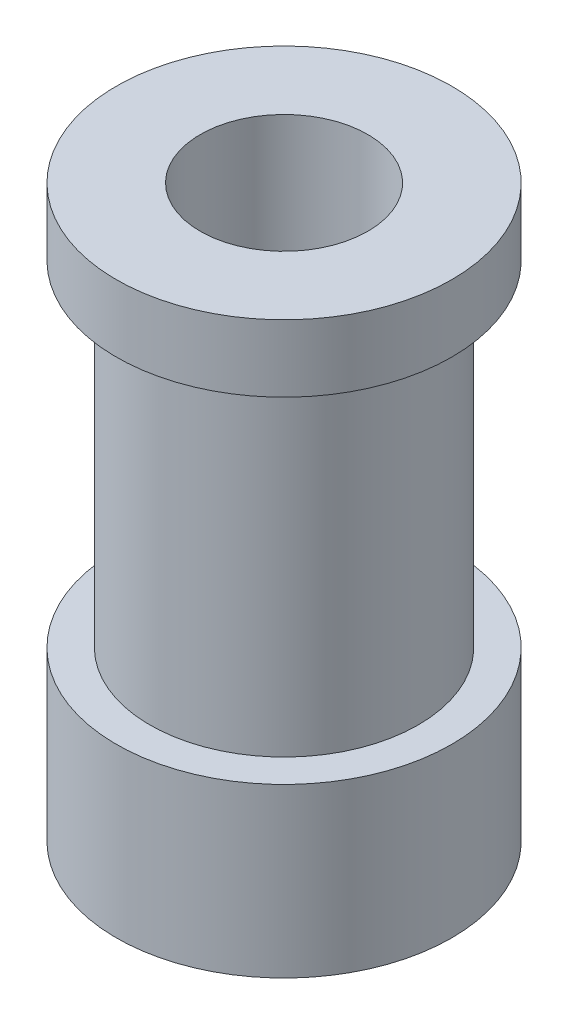
ISO-10303-21;
HEADER;
FILE_DESCRIPTION(('STEP AP214'),'2;1');
FILE_NAME('part.step','',(''),(''),'','','');
FILE_SCHEMA(('AUTOMOTIVE_DESIGN { 1 0 10303 214 1 1 1 1 }'));
ENDSEC;
DATA;
#1=APPLICATION_CONTEXT('core data for automotive mechanical design processes');
#2=APPLICATION_PROTOCOL_DEFINITION('international standard','automotive_design',2000,#1);
#3=PRODUCT_CONTEXT('',#1,'mechanical');
#4=PRODUCT('Part','Part','',(#3));
#5=PRODUCT_RELATED_PRODUCT_CATEGORY('part','',(#4));
#6=PRODUCT_DEFINITION_FORMATION('','',#4);
#7=PRODUCT_DEFINITION_CONTEXT('part definition',#1,'design');
#8=PRODUCT_DEFINITION('design','',#6,#7);
#9=PRODUCT_DEFINITION_SHAPE('','',#8);
#10=(LENGTH_UNIT() NAMED_UNIT(*) SI_UNIT(.MILLI.,.METRE.));
#11=(NAMED_UNIT(*) PLANE_ANGLE_UNIT() SI_UNIT($,.RADIAN.));
#12=(NAMED_UNIT(*) SI_UNIT($,.STERADIAN.) SOLID_ANGLE_UNIT());
#13=UNCERTAINTY_MEASURE_WITH_UNIT(LENGTH_MEASURE(1.E-05),#10,'distance_accuracy_value','');
#14=(GEOMETRIC_REPRESENTATION_CONTEXT(3) GLOBAL_UNCERTAINTY_ASSIGNED_CONTEXT((#13)) GLOBAL_UNIT_ASSIGNED_CONTEXT((#10,
#11,#12)) REPRESENTATION_CONTEXT('',''));
#15=CARTESIAN_POINT('',(0.,0.,0.));
#16=DIRECTION('',(0.,0.,1.));
#17=DIRECTION('',(1.,0.,0.));
#18=AXIS2_PLACEMENT_3D('',#15,#16,#17);
#19=CARTESIAN_POINT('',(0.,0.,0.));
#20=DIRECTION('',(0.,-1.,0.));
#21=DIRECTION('',(1.,0.,0.));
#22=AXIS2_PLACEMENT_3D('',#19,#20,#21);
#23=CYLINDRICAL_SURFACE('',#22,2.5);
#24=CARTESIAN_POINT('',(-2.29128784747792,2.5,-1.));
#25=CARTESIAN_POINT('',(-2.2912932582821,2.55356974904995,-0.999994127101895));
#26=CARTESIAN_POINT('',(-2.29319301242132,2.60721526735235,-0.995669909297177));
#27=CARTESIAN_POINT('',(-2.30055457093922,2.71296741643853,-0.978534515296366));
#28=CARTESIAN_POINT('',(-2.30602547693425,2.76506975854024,-0.965701652221066));
#29=CARTESIAN_POINT('',(-2.31980227895648,2.86602647098503,-0.932117516284353));
#30=CARTESIAN_POINT('',(-2.32809748178557,2.91489227368013,-0.911396076262713));
#31=CARTESIAN_POINT('',(-2.3465733254764,3.00844252542981,-0.862710134685806));
#32=CARTESIAN_POINT('',(-2.35675355451961,3.05312788457543,-0.834747214633751));
#33=CARTESIAN_POINT('',(-2.37850432525516,3.13963020112073,-0.770660987293711));
#34=CARTESIAN_POINT('',(-2.39011958979373,3.18117821146473,-0.734189678863665));
#35=CARTESIAN_POINT('',(-2.41306228489405,3.25776449865769,-0.654854552887023));
#36=CARTESIAN_POINT('',(-2.42438961368186,3.29280050064493,-0.611988510837841));
#37=CARTESIAN_POINT('',(-2.44601703953427,3.35670319849135,-0.519003155178191));
#38=CARTESIAN_POINT('',(-2.45625901841784,3.38527215073532,-0.468664482806142));
#39=CARTESIAN_POINT('',(-2.47401963815773,3.4334217841949,-0.363412661437561));
#40=CARTESIAN_POINT('',(-2.48153938692337,3.45300612289097,-0.308501384643982));
#41=CARTESIAN_POINT('',(-2.49269162504142,3.4816707432187,-0.198483213419447));
#42=CARTESIAN_POINT('',(-2.49649468387678,3.49121365704451,-0.143514492402304));
#43=CARTESIAN_POINT('',(-2.50040155341351,3.50101424283135,-0.032633164318827));
#44=CARTESIAN_POINT('',(-2.50050674384656,3.50127537796742,0.0232790829127));
#45=CARTESIAN_POINT('',(-2.49710981410893,3.49275861511251,0.131116247357655));
#46=CARTESIAN_POINT('',(-2.49380998385918,3.48448761362653,0.183088726437015));
#47=CARTESIAN_POINT('',(-2.48424645734395,3.46000356184462,0.284836554609168));
#48=CARTESIAN_POINT('',(-2.47798254360556,3.44378992879981,0.334611742195078));
#49=CARTESIAN_POINT('',(-2.4629841222885,3.40368175856185,0.431448969255827));
#50=CARTESIAN_POINT('',(-2.454213802334,3.37967514259223,0.478458811689816));
#51=CARTESIAN_POINT('',(-2.43507292589849,3.32476749654049,0.567904075370286));
#52=CARTESIAN_POINT('',(-2.42470182132537,3.29386410345119,0.610337921358053));
#53=CARTESIAN_POINT('',(-2.40260818589167,3.2236754320267,0.692384413996074));
#54=CARTESIAN_POINT('',(-2.3908416326012,3.18397305370808,0.73162892263682));
#55=CARTESIAN_POINT('',(-2.36780830482389,3.09850471408952,0.803053707692662));
#56=CARTESIAN_POINT('',(-2.35654169488173,3.05273677592292,0.835231671879827));
#57=CARTESIAN_POINT('',(-2.33548448720906,2.95479048879552,0.892452094371465));
#58=CARTESIAN_POINT('',(-2.3257445709069,2.90246758475809,0.917267325867451));
#59=CARTESIAN_POINT('',(-2.30943795233662,2.79389225476899,0.957588129983132));
#60=CARTESIAN_POINT('',(-2.3028691896167,2.73764240761458,0.973099749202198));
#61=CARTESIAN_POINT('',(-2.29414879836282,2.62648211128198,0.993477474415978));
#62=CARTESIAN_POINT('',(-2.29175183224037,2.57169977643992,0.998936048404204));
#63=CARTESIAN_POINT('',(-2.29094748938549,2.46196139611603,1.00078066322451));
#64=CARTESIAN_POINT('',(-2.29253890281231,2.40700540836108,0.99716945529644));
#65=CARTESIAN_POINT('',(-2.29928022178566,2.30177053252256,0.981516447394261));
#66=CARTESIAN_POINT('',(-2.30422228898885,2.25140353130025,0.969966531011727));
#67=CARTESIAN_POINT('',(-2.31685025513936,2.153355797607,0.939402093455638));
#68=CARTESIAN_POINT('',(-2.32453676244372,2.10567566344635,0.920385917151196));
#69=CARTESIAN_POINT('',(-2.34216890929975,2.01219882110226,0.874567819740726));
#70=CARTESIAN_POINT('',(-2.35219352319567,1.96655690565277,0.847481434132297));
#71=CARTESIAN_POINT('',(-2.37325192578918,1.88025850627917,0.786582612220937));
#72=CARTESIAN_POINT('',(-2.38428612448031,1.8396040636022,0.752767436740991));
#73=CARTESIAN_POINT('',(-2.40710457985698,1.76131329570039,0.676422105840241));
#74=CARTESIAN_POINT('',(-2.41888403642601,1.72412171735449,0.633432714722549));
#75=CARTESIAN_POINT('',(-2.44109897283781,1.65741146169483,0.541541816684421));
#76=CARTESIAN_POINT('',(-2.4515343979662,1.62789309670138,0.492640069233931));
#77=CARTESIAN_POINT('',(-2.46991857950142,1.57747618676939,0.39013996700088));
#78=CARTESIAN_POINT('',(-2.47786793120137,1.55657557791711,0.336542740497033));
#79=CARTESIAN_POINT('',(-2.49036356734645,1.52422557379619,0.226196795459613));
#80=CARTESIAN_POINT('',(-2.49491169853772,1.51277104927997,0.169449805147135));
#81=CARTESIAN_POINT('',(-2.49989504105256,1.50024764918731,0.0584082551731515));
#82=CARTESIAN_POINT('',(-2.50057923372436,1.49854993576868,0.00419524629652758));
#83=CARTESIAN_POINT('',(-2.49843021189296,1.50392773964205,-0.103716917866622));
#84=CARTESIAN_POINT('',(-2.49559752983456,1.51100192889281,-0.157416149697311));
#85=CARTESIAN_POINT('',(-2.48685756682127,1.53327339417924,-0.261085450973206));
#86=CARTESIAN_POINT('',(-2.48104740317165,1.54821447303778,-0.311119402324193));
#87=CARTESIAN_POINT('',(-2.46697473916018,1.58552640228091,-0.40796117737947));
#88=CARTESIAN_POINT('',(-2.45871178652005,1.60789862301017,-0.454768404133638));
#89=CARTESIAN_POINT('',(-2.44009047180029,1.66055159924467,-0.546101520928058));
#90=CARTESIAN_POINT('',(-2.42965564864115,1.69113814744254,-0.590435193403213));
#91=CARTESIAN_POINT('',(-2.40794701593223,1.75889425958947,-0.673527014262036));
#92=CARTESIAN_POINT('',(-2.3966728602525,1.79606654823006,-0.712282842872878));
#93=CARTESIAN_POINT('',(-2.37368881779711,1.87865761226252,-0.785600632542996));
#94=CARTESIAN_POINT('',(-2.36199516302691,1.92444443670055,-0.819754443599515));
#95=CARTESIAN_POINT('',(-2.3402483573759,2.02147106871438,-0.879923725219699));
#96=CARTESIAN_POINT('',(-2.33019539943727,2.07271151645493,-0.905938238949995));
#97=CARTESIAN_POINT('',(-2.31379432228954,2.17451860092403,-0.946995543836656));
#98=CARTESIAN_POINT('',(-2.30719459305824,2.22473261737559,-0.962813757082104));
#99=CARTESIAN_POINT('',(-2.29723001801982,2.32724270981517,-0.986358878909193));
#100=CARTESIAN_POINT('',(-2.29385616036087,2.37953255798348,-0.994108333944008));
#101=CARTESIAN_POINT('',(-2.29162229378817,2.45468878116896,-0.999232129155087));
#102=CARTESIAN_POINT('',(-2.29128555846678,2.4773376104988,-1.00000248449744));
#103=CARTESIAN_POINT('',(-2.29128784747792,2.5,-1.));
#104=B_SPLINE_CURVE_WITH_KNOTS('',3,(#24,#25,#26,#27,#28,#29,#30,#31,#32,#33,#34,#35,#36,#37,
#38,#39,#40,#41,#42,#43,#44,#45,#46,#47,#48,#49,#50,#51,#52,#53,#54,#55,#56,#57,#58,#59,#60,#61,
#62,#63,#64,#65,#66,#67,#68,#69,#70,#71,#72,#73,#74,#75,#76,#77,#78,#79,#80,#81,#82,#83,#84,#85,
#86,#87,#88,#89,#90,#91,#92,#93,#94,#95,#96,#97,#98,#99,#100,#101,#102,#103),.UNSPECIFIED.,.T.,
.F.,(4,2,2,2,2,2,2,2,2,2,2,2,2,2,2,2,2,2,2,2,2,2,2,2,2,2,2,2,2,2,2,2,2,2,2,2,2,2,2,4),(0.,
0.160638824383827,0.321688667911123,0.482135411646695,0.642547144119307,0.811278091422123,
0.980067871741711,1.15551334545714,1.3308873348474,1.49777091443592,1.66459222652836,
1.82204322415151,1.9795057756453,2.13934150117449,2.29923207470016,2.46962022040678,
2.64006403563563,2.81532229357288,2.99046652397056,3.15491073759215,3.31930507450975,
3.47433624039577,3.62940179322824,3.79075577323355,3.9521755725993,4.12551867120495,
4.29886882423379,4.47217743653411,4.64539187974073,4.80730519874981,4.96919400753306,
5.12610997218681,5.28305488911298,5.44693525566967,5.61088358279108,5.78498126639812,
5.95909940876599,6.11758330406543,6.27562315106627,6.34358052760367),.UNSPECIFIED.);
#105=CARTESIAN_POINT('',(-2.29128784747792,2.5,-1.));
#106=VERTEX_POINT('',#105);
#107=EDGE_CURVE('E56',#106,#106,#104,.T.);
#108=ORIENTED_EDGE('',*,*,#107,.F.);
#109=EDGE_LOOP('',(#108));
#110=FACE_BOUND('',#109,.T.);
#111=CARTESIAN_POINT('',(1.,2.5,-2.29128784747792));
#112=CARTESIAN_POINT('',(0.999994127101895,2.55356974904995,-2.2912932582821));
#113=CARTESIAN_POINT('',(0.995669909297177,2.60721526735235,-2.29319301242132));
#114=CARTESIAN_POINT('',(0.978534515296366,2.71296741643853,-2.30055457093922));
#115=CARTESIAN_POINT('',(0.965701652221066,2.76506975854024,-2.30602547693425));
#116=CARTESIAN_POINT('',(0.932117516284353,2.86602647098503,-2.31980227895648));
#117=CARTESIAN_POINT('',(0.911396076262713,2.91489227368013,-2.32809748178557));
#118=CARTESIAN_POINT('',(0.862710134685806,3.00844252542981,-2.3465733254764));
#119=CARTESIAN_POINT('',(0.83474721463375,3.05312788457543,-2.35675355451961));
#120=CARTESIAN_POINT('',(0.770660987293711,3.13963020112073,-2.37850432525516));
#121=CARTESIAN_POINT('',(0.734189678863665,3.18117821146473,-2.39011958979373));
#122=CARTESIAN_POINT('',(0.654854552887023,3.25776449865769,-2.41306228489405));
#123=CARTESIAN_POINT('',(0.611988510837842,3.29280050064493,-2.42438961368186));
#124=CARTESIAN_POINT('',(0.519003155178191,3.35670319849135,-2.44601703953427));
#125=CARTESIAN_POINT('',(0.468664482806142,3.38527215073532,-2.45625901841784));
#126=CARTESIAN_POINT('',(0.363412661437562,3.4334217841949,-2.47401963815773));
#127=CARTESIAN_POINT('',(0.308501384643983,3.45300612289097,-2.48153938692337));
#128=CARTESIAN_POINT('',(0.198483213419448,3.4816707432187,-2.49269162504142));
#129=CARTESIAN_POINT('',(0.143514492402304,3.49121365704451,-2.49649468387678));
#130=CARTESIAN_POINT('',(0.0326331643188272,3.50101424283135,-2.50040155341351));
#131=CARTESIAN_POINT('',(-0.0232790829126999,3.50127537796742,-2.50050674384656));
#132=CARTESIAN_POINT('',(-0.131116247357654,3.49275861511251,-2.49710981410893));
#133=CARTESIAN_POINT('',(-0.183088726437015,3.48448761362653,-2.49380998385918));
#134=CARTESIAN_POINT('',(-0.284836554609168,3.46000356184462,-2.48424645734395));
#135=CARTESIAN_POINT('',(-0.334611742195078,3.4437899287998,-2.47798254360556));
#136=CARTESIAN_POINT('',(-0.431448969255827,3.40368175856185,-2.4629841222885));
#137=CARTESIAN_POINT('',(-0.478458811689816,3.37967514259223,-2.454213802334));
#138=CARTESIAN_POINT('',(-0.567904075370286,3.32476749654049,-2.43507292589849));
#139=CARTESIAN_POINT('',(-0.610337921358053,3.29386410345119,-2.42470182132537));
#140=CARTESIAN_POINT('',(-0.692384413996074,3.2236754320267,-2.40260818589167));
#141=CARTESIAN_POINT('',(-0.73162892263682,3.18397305370808,-2.3908416326012));
#142=CARTESIAN_POINT('',(-0.803053707692661,3.09850471408952,-2.36780830482389));
#143=CARTESIAN_POINT('',(-0.835231671879827,3.05273677592292,-2.35654169488173));
#144=CARTESIAN_POINT('',(-0.892452094371465,2.95479048879552,-2.33548448720906));
#145=CARTESIAN_POINT('',(-0.917267325867451,2.90246758475809,-2.3257445709069));
#146=CARTESIAN_POINT('',(-0.957588129983132,2.79389225476899,-2.30943795233662));
#147=CARTESIAN_POINT('',(-0.973099749202199,2.73764240761458,-2.30286918961669));
#148=CARTESIAN_POINT('',(-0.993477474415978,2.62648211128197,-2.29414879836282));
#149=CARTESIAN_POINT('',(-0.998936048404204,2.57169977643992,-2.29175183224038));
#150=CARTESIAN_POINT('',(-1.00078066322451,2.46196139611603,-2.29094748938549));
#151=CARTESIAN_POINT('',(-0.99716945529644,2.40700540836108,-2.29253890281231));
#152=CARTESIAN_POINT('',(-0.981516447394261,2.30177053252256,-2.29928022178566));
#153=CARTESIAN_POINT('',(-0.969966531011727,2.25140353130025,-2.30422228898885));
#154=CARTESIAN_POINT('',(-0.939402093455637,2.153355797607,-2.31685025513936));
#155=CARTESIAN_POINT('',(-0.920385917151195,2.10567566344634,-2.32453676244372));
#156=CARTESIAN_POINT('',(-0.874567819740726,2.01219882110226,-2.34216890929975));
#157=CARTESIAN_POINT('',(-0.847481434132296,1.96655690565277,-2.35219352319567));
#158=CARTESIAN_POINT('',(-0.786582612220937,1.88025850627917,-2.37325192578918));
#159=CARTESIAN_POINT('',(-0.752767436740991,1.8396040636022,-2.38428612448031));
#160=CARTESIAN_POINT('',(-0.676422105840241,1.76131329570039,-2.40710457985698));
#161=CARTESIAN_POINT('',(-0.633432714722548,1.72412171735449,-2.41888403642601));
#162=CARTESIAN_POINT('',(-0.541541816684421,1.65741146169483,-2.44109897283781));
#163=CARTESIAN_POINT('',(-0.492640069233931,1.62789309670138,-2.4515343979662));
#164=CARTESIAN_POINT('',(-0.390139967000879,1.57747618676939,-2.46991857950142));
#165=CARTESIAN_POINT('',(-0.336542740497031,1.55657557791711,-2.47786793120137));
#166=CARTESIAN_POINT('',(-0.226196795459611,1.52422557379619,-2.49036356734645));
#167=CARTESIAN_POINT('',(-0.169449805147133,1.51277104927997,-2.49491169853772));
#168=CARTESIAN_POINT('',(-0.0584082551731507,1.50024764918731,-2.49989504105256));
#169=CARTESIAN_POINT('',(-0.00419524629652691,1.49854993576868,-2.50057923372436));
#170=CARTESIAN_POINT('',(0.103716917866623,1.50392773964205,-2.49843021189296));
#171=CARTESIAN_POINT('',(0.157416149697312,1.51100192889281,-2.49559752983456));
#172=CARTESIAN_POINT('',(0.261085450973207,1.53327339417924,-2.48685756682127));
#173=CARTESIAN_POINT('',(0.311119402324194,1.54821447303778,-2.48104740317165));
#174=CARTESIAN_POINT('',(0.407961177379471,1.58552640228091,-2.46697473916018));
#175=CARTESIAN_POINT('',(0.454768404133639,1.60789862301017,-2.45871178652005));
#176=CARTESIAN_POINT('',(0.546101520928059,1.66055159924467,-2.44009047180029));
#177=CARTESIAN_POINT('',(0.590435193403214,1.69113814744254,-2.42965564864115));
#178=CARTESIAN_POINT('',(0.673527014262037,1.75889425958947,-2.40794701593223));
#179=CARTESIAN_POINT('',(0.712282842872879,1.79606654823006,-2.3966728602525));
#180=CARTESIAN_POINT('',(0.785600632542997,1.87865761226252,-2.37368881779711));
#181=CARTESIAN_POINT('',(0.819754443599515,1.92444443670055,-2.36199516302691));
#182=CARTESIAN_POINT('',(0.8799237252197,2.02147106871439,-2.3402483573759));
#183=CARTESIAN_POINT('',(0.905938238949995,2.07271151645493,-2.33019539943727));
#184=CARTESIAN_POINT('',(0.946995543836656,2.17451860092404,-2.31379432228954));
#185=CARTESIAN_POINT('',(0.962813757082104,2.22473261737559,-2.30719459305824));
#186=CARTESIAN_POINT('',(0.986358878909193,2.32724270981517,-2.29723001801982));
#187=CARTESIAN_POINT('',(0.994108333944008,2.37953255798348,-2.29385616036087));
#188=CARTESIAN_POINT('',(0.999232129155087,2.45468878116896,-2.29162229378817));
#189=CARTESIAN_POINT('',(1.00000248449744,2.4773376104988,-2.29128555846678));
#190=CARTESIAN_POINT('',(1.,2.5,-2.29128784747792));
#191=B_SPLINE_CURVE_WITH_KNOTS('',3,(#111,#112,#113,#114,#115,#116,#117,#118,#119,#120,#121,
#122,#123,#124,#125,#126,#127,#128,#129,#130,#131,#132,#133,#134,#135,#136,#137,#138,#139,#140,
#141,#142,#143,#144,#145,#146,#147,#148,#149,#150,#151,#152,#153,#154,#155,#156,#157,#158,#159,
#160,#161,#162,#163,#164,#165,#166,#167,#168,#169,#170,#171,#172,#173,#174,#175,#176,#177,#178,
#179,#180,#181,#182,#183,#184,#185,#186,#187,#188,#189,#190),.UNSPECIFIED.,.T.,.F.,(4,2,2,2,2,2,
2,2,2,2,2,2,2,2,2,2,2,2,2,2,2,2,2,2,2,2,2,2,2,2,2,2,2,2,2,2,2,2,2,4),(0.,0.160638824383828,
0.321688667911123,0.482135411646696,0.642547144119307,0.811278091422123,0.980067871741711,
1.15551334545714,1.3308873348474,1.49777091443592,1.66459222652836,1.82204322415151,
1.9795057756453,2.13934150117449,2.29923207470015,2.46962022040678,2.64006403563563,
2.81532229357288,2.99046652397056,3.15491073759215,3.31930507450975,3.47433624039577,
3.62940179322824,3.79075577323355,3.9521755725993,4.12551867120495,4.29886882423379,
4.47217743653411,4.64539187974073,4.80730519874981,4.96919400753306,5.12610997218681,
5.28305488911298,5.44693525566968,5.61088358279108,5.78498126639812,5.95909940876599,
6.11758330406543,6.27562315106627,6.34358052760367),.UNSPECIFIED.);
#192=CARTESIAN_POINT('',(1.,2.5,-2.29128784747792));
#193=VERTEX_POINT('',#192);
#194=EDGE_CURVE('E55',#193,#193,#191,.T.);
#195=ORIENTED_EDGE('',*,*,#194,.F.);
#196=EDGE_LOOP('',(#195));
#197=FACE_BOUND('',#196,.T.);
#198=CARTESIAN_POINT('',(0.,0.,0.));
#199=DIRECTION('',(0.,-1.,0.));
#200=DIRECTION('',(1.,0.,0.));
#201=AXIS2_PLACEMENT_3D('',#198,#199,#200);
#202=CIRCLE('',#201,2.49999999999999);
#203=CARTESIAN_POINT('',(2.49999999999999,0.,0.));
#204=VERTEX_POINT('',#203);
#205=EDGE_CURVE('E10',#204,#204,#202,.T.);
#206=ORIENTED_EDGE('',*,*,#205,.T.);
#207=EDGE_LOOP('',(#206));
#208=FACE_BOUND('',#207,.T.);
#209=CARTESIAN_POINT('',(0.,17.,0.));
#210=DIRECTION('',(0.,-1.,0.));
#211=DIRECTION('',(1.,0.,0.));
#212=AXIS2_PLACEMENT_3D('',#209,#210,#211);
#213=CIRCLE('',#212,2.5);
#214=CARTESIAN_POINT('',(2.5,17.,0.));
#215=VERTEX_POINT('',#214);
#216=EDGE_CURVE('E76',#215,#215,#213,.T.);
#217=ORIENTED_EDGE('',*,*,#216,.F.);
#218=EDGE_LOOP('',(#217));
#219=FACE_BOUND('',#218,.T.);
#220=ADVANCED_FACE('F30',(#110,#197,#208,#219),#23,.F.);
#221=CARTESIAN_POINT('',(2.49999999999999,0.,0.));
#222=DIRECTION('',(0.,-1.,0.));
#223=DIRECTION('',(1.,0.,0.));
#224=AXIS2_PLACEMENT_3D('',#221,#222,#223);
#225=PLANE('',#224);
#226=CARTESIAN_POINT('',(0.,0.,0.));
#227=DIRECTION('',(0.,-1.,0.));
#228=DIRECTION('',(1.,0.,0.));
#229=AXIS2_PLACEMENT_3D('',#226,#227,#228);
#230=CIRCLE('',#229,5.);
#231=CARTESIAN_POINT('',(5.,0.,0.));
#232=VERTEX_POINT('',#231);
#233=EDGE_CURVE('E42',#232,#232,#230,.T.);
#234=ORIENTED_EDGE('',*,*,#233,.T.);
#235=EDGE_LOOP('',(#234));
#236=FACE_BOUND('',#235,.T.);
#237=ORIENTED_EDGE('',*,*,#205,.F.);
#238=EDGE_LOOP('',(#237));
#239=FACE_BOUND('',#238,.T.);
#240=ADVANCED_FACE('F108',(#236,#239),#225,.T.);
#241=CARTESIAN_POINT('',(0.,0.,0.));
#242=DIRECTION('',(0.,-1.,0.));
#243=DIRECTION('',(1.,0.,0.));
#244=AXIS2_PLACEMENT_3D('',#241,#242,#243);
#245=CYLINDRICAL_SURFACE('',#244,5.);
#246=CARTESIAN_POINT('',(-4.89897948556636,2.5,-1.));
#247=CARTESIAN_POINT('',(-4.89898059043933,2.44443562451802,-0.999997945876046));
#248=CARTESIAN_POINT('',(-4.89993508346913,2.38884537669351,-0.995353171723657));
#249=CARTESIAN_POINT('',(-4.90364431385263,2.27923749488159,-0.976912283588336));
#250=CARTESIAN_POINT('',(-4.90640049166333,2.22522115536893,-0.963108847071182));
#251=CARTESIAN_POINT('',(-4.91338873700356,2.12036269663707,-0.926795782617739));
#252=CARTESIAN_POINT('',(-4.91761933615313,2.06951747846507,-0.904294814152083));
#253=CARTESIAN_POINT('',(-4.92707799486421,1.97232515530538,-0.851249107671044));
#254=CARTESIAN_POINT('',(-4.93230599875014,1.92597779946273,-0.820704818601297));
#255=CARTESIAN_POINT('',(-4.9432529969268,1.8384389961455,-0.75197907565329));
#256=CARTESIAN_POINT('',(-4.94897737836825,1.79732041211586,-0.71370565591328));
#257=CARTESIAN_POINT('',(-4.9602247230302,1.72204246642119,-0.63080678902135));
#258=CARTESIAN_POINT('',(-4.96574767210945,1.68788359258285,-0.586180896977996));
#259=CARTESIAN_POINT('',(-4.97602796417448,1.62721198237149,-0.491361355924246));
#260=CARTESIAN_POINT('',(-4.9807782144152,1.60076848618335,-0.441122567672208));
#261=CARTESIAN_POINT('',(-4.98891736883662,1.55672506295188,-0.336804150387275));
#262=CARTESIAN_POINT('',(-4.99230640044127,1.53912430809901,-0.282724881420554));
#263=CARTESIAN_POINT('',(-4.9973032068841,1.51349280638037,-0.173016773278494));
#264=CARTESIAN_POINT('',(-4.99893386288125,1.50533902242899,-0.117417739214815));
#265=CARTESIAN_POINT('',(-5.00030921183606,1.49844904816169,-0.00561856843753734));
#266=CARTESIAN_POINT('',(-5.0000540865276,1.49971195035418,0.0505815098318422));
#267=CARTESIAN_POINT('',(-4.99770434868515,1.51152618021555,0.161142000743588));
#268=CARTESIAN_POINT('',(-4.99563598365838,1.52194497716785,0.215517214298469));
#269=CARTESIAN_POINT('',(-4.98992177159409,1.55156503245889,0.3217316265803));
#270=CARTESIAN_POINT('',(-4.98627586144039,1.57076664219187,0.373570723747128));
#271=CARTESIAN_POINT('',(-4.97777296019959,1.61753004014727,0.473619463200887));
#272=CARTESIAN_POINT('',(-4.97290848175224,1.64514375110489,0.521804174133899));
#273=CARTESIAN_POINT('',(-4.96250469473785,1.7079090772366,0.612905045859755));
#274=CARTESIAN_POINT('',(-4.95696530855222,1.74306155977052,0.655820599525));
#275=CARTESIAN_POINT('',(-4.9457096436446,1.82063362210847,0.735951431053457));
#276=CARTESIAN_POINT('',(-4.93999196457516,1.86316918672959,0.773054316573631));
#277=CARTESIAN_POINT('',(-4.92911571598761,1.95391644245075,0.839618493176806));
#278=CARTESIAN_POINT('',(-4.92395715704548,2.0021282408832,0.86907963972775));
#279=CARTESIAN_POINT('',(-4.91478047472924,2.10302083182181,0.919562814801881));
#280=CARTESIAN_POINT('',(-4.91076481563549,2.15571096763966,0.940566647777709));
#281=CARTESIAN_POINT('',(-4.90436476321273,2.26397132372399,0.973390341627581));
#282=CARTESIAN_POINT('',(-4.90198015728428,2.31954116761908,0.985211399456641));
#283=CARTESIAN_POINT('',(-4.89915479267828,2.43096485799904,0.99916600603605));
#284=CARTESIAN_POINT('',(-4.89868147057154,2.48679757431034,1.00146185889791));
#285=CARTESIAN_POINT('',(-4.89964485688854,2.59804822319968,0.996737628310738));
#286=CARTESIAN_POINT('',(-4.90108145700388,2.65346617911886,0.989718073122441));
#287=CARTESIAN_POINT('',(-4.90567232494915,2.76176864029223,0.966702208074156));
#288=CARTESIAN_POINT('',(-4.90880999014497,2.81467234303576,0.950792620839297));
#289=CARTESIAN_POINT('',(-4.91643489351665,2.91706327902874,0.910541035308517));
#290=CARTESIAN_POINT('',(-4.9209222428627,2.96655023043572,0.886198342373176));
#291=CARTESIAN_POINT('',(-4.93081405962039,3.06141310995016,0.829404142215597));
#292=CARTESIAN_POINT('',(-4.93622971864903,3.10672704630083,0.796851077982753));
#293=CARTESIAN_POINT('',(-4.94733723826637,3.19130831200092,0.724695572212711));
#294=CARTESIAN_POINT('',(-4.95302912723818,3.23057501824925,0.685092405144536));
#295=CARTESIAN_POINT('',(-4.96415345869216,3.30256255918558,0.59923227349789));
#296=CARTESIAN_POINT('',(-4.96958057708684,3.33517365465,0.552882498929629));
#297=CARTESIAN_POINT('',(-4.9794712762862,3.39214588149958,0.455267896634755));
#298=CARTESIAN_POINT('',(-4.98393489755211,3.41650735934478,0.404003275433506));
#299=CARTESIAN_POINT('',(-4.99137294061067,3.45612887174663,0.298302680824012));
#300=CARTESIAN_POINT('',(-4.99435579142604,3.47144051822625,0.243886673478077));
#301=CARTESIAN_POINT('',(-4.9985323593766,3.49269124766385,0.133189454679912));
#302=CARTESIAN_POINT('',(-4.99972629199843,3.49863145947568,0.0769084687112136));
#303=CARTESIAN_POINT('',(-5.00018540454121,3.50092698096289,-0.0348728939036239));
#304=CARTESIAN_POINT('',(-4.99948378549351,3.49744728045621,-0.0903698121415028));
#305=CARTESIAN_POINT('',(-4.99630043560318,3.48136604945219,-0.199971031315642));
#306=CARTESIAN_POINT('',(-4.99381872714351,3.46876463365193,-0.254075349753692));
#307=CARTESIAN_POINT('',(-4.98735498365001,3.43487100790836,-0.359252749745097));
#308=CARTESIAN_POINT('',(-4.98337637247912,3.41359862186882,-0.410332443240281));
#309=CARTESIAN_POINT('',(-4.97434722123382,3.3629877586691,-0.508221220185953));
#310=CARTESIAN_POINT('',(-4.96929659645878,3.33364864409628,-0.555029965767412));
#311=CARTESIAN_POINT('',(-4.95857599157868,3.26718061293792,-0.643863890106358));
#312=CARTESIAN_POINT('',(-4.95289733422142,3.22993366361323,-0.685799716116505));
#313=CARTESIAN_POINT('',(-4.94161222903622,3.14894975990422,-0.762882617756847));
#314=CARTESIAN_POINT('',(-4.93600579862875,3.10521127053126,-0.798028083202713));
#315=CARTESIAN_POINT('',(-4.92543342749964,3.01192068329982,-0.860892219455201));
#316=CARTESIAN_POINT('',(-4.92047503631328,2.96231103883963,-0.888526814639768));
#317=CARTESIAN_POINT('',(-4.91185237184445,2.85906722670031,-0.935024049287809));
#318=CARTESIAN_POINT('',(-4.90818692536957,2.80543676130208,-0.953894645979291));
#319=CARTESIAN_POINT('',(-4.90329681128922,2.70973754456343,-0.978669139854274));
#320=CARTESIAN_POINT('',(-4.90168784915661,2.66821458048854,-0.986653898522987));
#321=CARTESIAN_POINT('',(-4.8995287845803,2.58446604544636,-0.99732001796041));
#322=CARTESIAN_POINT('',(-4.89897864563277,2.54224049875183,-1.00000156156206));
#323=CARTESIAN_POINT('',(-4.89897948556636,2.5,-1.));
#324=B_SPLINE_CURVE_WITH_KNOTS('',3,(#246,#247,#248,#249,#250,#251,#252,#253,#254,#255,#256,
#257,#258,#259,#260,#261,#262,#263,#264,#265,#266,#267,#268,#269,#270,#271,#272,#273,#274,#275,
#276,#277,#278,#279,#280,#281,#282,#283,#284,#285,#286,#287,#288,#289,#290,#291,#292,#293,#294,
#295,#296,#297,#298,#299,#300,#301,#302,#303,#304,#305,#306,#307,#308,#309,#310,#311,#312,#313,
#314,#315,#316,#317,#318,#319,#320,#321,#322,#323),.UNSPECIFIED.,.T.,.F.,(4,2,2,2,2,2,2,2,2,2,2,
2,2,2,2,2,2,2,2,2,2,2,2,2,2,2,2,2,2,2,2,2,2,2,2,2,2,2,4),(0.,0.166538463856524,
0.333210239259264,0.499716497915554,0.666213464834832,0.834822525459335,1.00344340032919,
1.17353400434947,1.34360868244057,1.51144248880577,1.67926012113745,1.84468789631034,
2.01012229071247,2.176599242198,2.34309535767563,2.5124934675998,2.68189478120217,
2.85165863170273,3.02140035013522,3.1882375780209,3.35506534525918,3.52029341780816,
3.68553510351895,3.85293059772018,4.02034332867706,4.19032601730948,4.36030156627602,
4.52929813576147,4.69827434689125,4.86431017412183,5.03034391364254,5.19600017072949,
5.36166952132181,5.53001152023094,5.69839338887278,5.86858898576538,6.0386297508643,
6.16523803634393,6.29184195681712),.UNSPECIFIED.);
#325=CARTESIAN_POINT('',(-4.89897948556636,2.5,-1.));
#326=VERTEX_POINT('',#325);
#327=EDGE_CURVE('E34',#326,#326,#324,.T.);
#328=ORIENTED_EDGE('',*,*,#327,.F.);
#329=EDGE_LOOP('',(#328));
#330=FACE_BOUND('',#329,.T.);
#331=CARTESIAN_POINT('',(1.,2.5,-4.89897948556636));
#332=CARTESIAN_POINT('',(0.999997945876046,2.44443562451802,-4.89898059043933));
#333=CARTESIAN_POINT('',(0.995353171723657,2.38884537669351,-4.89993508346913));
#334=CARTESIAN_POINT('',(0.976912283588336,2.27923749488159,-4.90364431385263));
#335=CARTESIAN_POINT('',(0.963108847071182,2.22522115536893,-4.90640049166333));
#336=CARTESIAN_POINT('',(0.926795782617739,2.12036269663707,-4.91338873700356));
#337=CARTESIAN_POINT('',(0.904294814152083,2.06951747846507,-4.91761933615313));
#338=CARTESIAN_POINT('',(0.851249107671044,1.97232515530538,-4.92707799486421));
#339=CARTESIAN_POINT('',(0.820704818601297,1.92597779946273,-4.93230599875014));
#340=CARTESIAN_POINT('',(0.75197907565329,1.8384389961455,-4.9432529969268));
#341=CARTESIAN_POINT('',(0.71370565591328,1.79732041211586,-4.94897737836825));
#342=CARTESIAN_POINT('',(0.63080678902135,1.72204246642119,-4.9602247230302));
#343=CARTESIAN_POINT('',(0.586180896977996,1.68788359258285,-4.96574767210945));
#344=CARTESIAN_POINT('',(0.491361355924246,1.62721198237149,-4.97602796417448));
#345=CARTESIAN_POINT('',(0.441122567672208,1.60076848618335,-4.9807782144152));
#346=CARTESIAN_POINT('',(0.336804150387275,1.55672506295188,-4.98891736883662));
#347=CARTESIAN_POINT('',(0.282724881420554,1.53912430809901,-4.99230640044127));
#348=CARTESIAN_POINT('',(0.173016773278494,1.51349280638037,-4.9973032068841));
#349=CARTESIAN_POINT('',(0.117417739214815,1.50533902242899,-4.99893386288125));
#350=CARTESIAN_POINT('',(0.00561856843753734,1.49844904816169,-5.00030921183606));
#351=CARTESIAN_POINT('',(-0.0505815098318422,1.49971195035418,-5.0000540865276));
#352=CARTESIAN_POINT('',(-0.161142000743588,1.51152618021555,-4.99770434868515));
#353=CARTESIAN_POINT('',(-0.215517214298469,1.52194497716785,-4.99563598365838));
#354=CARTESIAN_POINT('',(-0.3217316265803,1.55156503245889,-4.98992177159409));
#355=CARTESIAN_POINT('',(-0.373570723747128,1.57076664219187,-4.98627586144039));
#356=CARTESIAN_POINT('',(-0.473619463200887,1.61753004014727,-4.97777296019959));
#357=CARTESIAN_POINT('',(-0.521804174133899,1.64514375110489,-4.97290848175224));
#358=CARTESIAN_POINT('',(-0.612905045859755,1.7079090772366,-4.96250469473785));
#359=CARTESIAN_POINT('',(-0.655820599525,1.74306155977052,-4.95696530855222));
#360=CARTESIAN_POINT('',(-0.735951431053457,1.82063362210847,-4.9457096436446));
#361=CARTESIAN_POINT('',(-0.773054316573631,1.86316918672959,-4.93999196457516));
#362=CARTESIAN_POINT('',(-0.839618493176806,1.95391644245075,-4.92911571598761));
#363=CARTESIAN_POINT('',(-0.86907963972775,2.0021282408832,-4.92395715704548));
#364=CARTESIAN_POINT('',(-0.919562814801881,2.10302083182181,-4.91478047472924));
#365=CARTESIAN_POINT('',(-0.940566647777709,2.15571096763966,-4.91076481563549));
#366=CARTESIAN_POINT('',(-0.973390341627581,2.26397132372399,-4.90436476321273));
#367=CARTESIAN_POINT('',(-0.985211399456641,2.31954116761908,-4.90198015728428));
#368=CARTESIAN_POINT('',(-0.99916600603605,2.43096485799904,-4.89915479267828));
#369=CARTESIAN_POINT('',(-1.00146185889791,2.48679757431034,-4.89868147057154));
#370=CARTESIAN_POINT('',(-0.996737628310738,2.59804822319968,-4.89964485688854));
#371=CARTESIAN_POINT('',(-0.989718073122441,2.65346617911886,-4.90108145700388));
#372=CARTESIAN_POINT('',(-0.966702208074156,2.76176864029223,-4.90567232494915));
#373=CARTESIAN_POINT('',(-0.950792620839297,2.81467234303576,-4.90880999014497));
#374=CARTESIAN_POINT('',(-0.910541035308517,2.91706327902874,-4.91643489351665));
#375=CARTESIAN_POINT('',(-0.886198342373176,2.96655023043572,-4.9209222428627));
#376=CARTESIAN_POINT('',(-0.829404142215597,3.06141310995016,-4.93081405962039));
#377=CARTESIAN_POINT('',(-0.796851077982753,3.10672704630083,-4.93622971864903));
#378=CARTESIAN_POINT('',(-0.724695572212711,3.19130831200092,-4.94733723826637));
#379=CARTESIAN_POINT('',(-0.685092405144536,3.23057501824925,-4.95302912723818));
#380=CARTESIAN_POINT('',(-0.59923227349789,3.30256255918558,-4.96415345869216));
#381=CARTESIAN_POINT('',(-0.552882498929629,3.33517365465,-4.96958057708684));
#382=CARTESIAN_POINT('',(-0.455267896634755,3.39214588149958,-4.9794712762862));
#383=CARTESIAN_POINT('',(-0.404003275433506,3.41650735934478,-4.98393489755211));
#384=CARTESIAN_POINT('',(-0.298302680824012,3.45612887174663,-4.99137294061067));
#385=CARTESIAN_POINT('',(-0.243886673478076,3.47144051822625,-4.99435579142604));
#386=CARTESIAN_POINT('',(-0.133189454679911,3.49269124766385,-4.9985323593766));
#387=CARTESIAN_POINT('',(-0.0769084687112131,3.49863145947568,-4.99972629199843));
#388=CARTESIAN_POINT('',(0.0348728939036243,3.50092698096289,-5.00018540454121));
#389=CARTESIAN_POINT('',(0.0903698121415034,3.49744728045621,-4.99948378549351));
#390=CARTESIAN_POINT('',(0.199971031315643,3.48136604945219,-4.99630043560318));
#391=CARTESIAN_POINT('',(0.254075349753692,3.46876463365193,-4.99381872714351));
#392=CARTESIAN_POINT('',(0.359252749745097,3.43487100790836,-4.98735498365001));
#393=CARTESIAN_POINT('',(0.410332443240282,3.41359862186882,-4.98337637247912));
#394=CARTESIAN_POINT('',(0.508221220185954,3.3629877586691,-4.97434722123382));
#395=CARTESIAN_POINT('',(0.555029965767412,3.33364864409628,-4.96929659645878));
#396=CARTESIAN_POINT('',(0.643863890106358,3.26718061293792,-4.95857599157868));
#397=CARTESIAN_POINT('',(0.685799716116504,3.22993366361323,-4.95289733422142));
#398=CARTESIAN_POINT('',(0.762882617756847,3.14894975990423,-4.94161222903622));
#399=CARTESIAN_POINT('',(0.798028083202713,3.10521127053126,-4.93600579862875));
#400=CARTESIAN_POINT('',(0.860892219455201,3.01192068329982,-4.92543342749964));
#401=CARTESIAN_POINT('',(0.888526814639768,2.96231103883963,-4.92047503631328));
#402=CARTESIAN_POINT('',(0.935024049287809,2.85906722670031,-4.91185237184445));
#403=CARTESIAN_POINT('',(0.953894645979291,2.80543676130208,-4.90818692536957));
#404=CARTESIAN_POINT('',(0.978669139854274,2.70973754456343,-4.90329681128922));
#405=CARTESIAN_POINT('',(0.986653898522986,2.66821458048855,-4.90168784915661));
#406=CARTESIAN_POINT('',(0.99732001796041,2.58446604544636,-4.8995287845803));
#407=CARTESIAN_POINT('',(1.00000156156206,2.54224049875183,-4.89897864563277));
#408=CARTESIAN_POINT('',(1.,2.5,-4.89897948556636));
#409=B_SPLINE_CURVE_WITH_KNOTS('',3,(#331,#332,#333,#334,#335,#336,#337,#338,#339,#340,#341,
#342,#343,#344,#345,#346,#347,#348,#349,#350,#351,#352,#353,#354,#355,#356,#357,#358,#359,#360,
#361,#362,#363,#364,#365,#366,#367,#368,#369,#370,#371,#372,#373,#374,#375,#376,#377,#378,#379,
#380,#381,#382,#383,#384,#385,#386,#387,#388,#389,#390,#391,#392,#393,#394,#395,#396,#397,#398,
#399,#400,#401,#402,#403,#404,#405,#406,#407,#408),.UNSPECIFIED.,.T.,.F.,(4,2,2,2,2,2,2,2,2,2,2,
2,2,2,2,2,2,2,2,2,2,2,2,2,2,2,2,2,2,2,2,2,2,2,2,2,2,2,4),(0.,0.166538463856524,
0.333210239259264,0.499716497915554,0.666213464834832,0.834822525459335,1.00344340032919,
1.17353400434947,1.34360868244057,1.51144248880577,1.67926012113745,1.84468789631034,
2.01012229071247,2.176599242198,2.34309535767563,2.5124934675998,2.68189478120217,
2.85165863170273,3.02140035013522,3.1882375780209,3.35506534525918,3.52029341780816,
3.68553510351895,3.85293059772018,4.02034332867706,4.19032601730948,4.36030156627602,
4.52929813576147,4.69827434689125,4.86431017412183,5.03034391364253,5.19600017072949,
5.36166952132181,5.53001152023093,5.69839338887278,5.86858898576538,6.03862975086429,
6.16523803634393,6.29184195681711),.UNSPECIFIED.);
#410=CARTESIAN_POINT('',(1.,2.5,-4.89897948556636));
#411=VERTEX_POINT('',#410);
#412=EDGE_CURVE('E50',#411,#411,#409,.T.);
#413=ORIENTED_EDGE('',*,*,#412,.F.);
#414=EDGE_LOOP('',(#413));
#415=FACE_BOUND('',#414,.T.);
#416=CARTESIAN_POINT('',(0.,5.,0.));
#417=DIRECTION('',(0.,-1.,0.));
#418=DIRECTION('',(1.,0.,0.));
#419=AXIS2_PLACEMENT_3D('',#416,#417,#418);
#420=CIRCLE('',#419,5.);
#421=CARTESIAN_POINT('',(5.,5.,0.));
#422=VERTEX_POINT('',#421);
#423=EDGE_CURVE('E47',#422,#422,#420,.T.);
#424=ORIENTED_EDGE('',*,*,#423,.T.);
#425=EDGE_LOOP('',(#424));
#426=FACE_BOUND('',#425,.T.);
#427=ORIENTED_EDGE('',*,*,#233,.F.);
#428=EDGE_LOOP('',(#427));
#429=FACE_BOUND('',#428,.T.);
#430=ADVANCED_FACE('F57',(#330,#415,#426,#429),#245,.T.);
#431=CARTESIAN_POINT('',(5.,5.,0.));
#432=DIRECTION('',(0.,1.,0.));
#433=DIRECTION('',(-1.,0.,0.));
#434=AXIS2_PLACEMENT_3D('',#431,#432,#433);
#435=PLANE('',#434);
#436=CARTESIAN_POINT('',(0.,5.,0.));
#437=DIRECTION('',(0.,-1.,0.));
#438=DIRECTION('',(1.,0.,0.));
#439=AXIS2_PLACEMENT_3D('',#436,#437,#438);
#440=CIRCLE('',#439,4.);
#441=CARTESIAN_POINT('',(4.,5.,0.));
#442=VERTEX_POINT('',#441);
#443=EDGE_CURVE('E90',#442,#442,#440,.T.);
#444=ORIENTED_EDGE('',*,*,#443,.T.);
#445=EDGE_LOOP('',(#444));
#446=FACE_BOUND('',#445,.T.);
#447=ORIENTED_EDGE('',*,*,#423,.F.);
#448=EDGE_LOOP('',(#447));
#449=FACE_BOUND('',#448,.T.);
#450=ADVANCED_FACE('F97',(#446,#449),#435,.T.);
#451=CARTESIAN_POINT('',(0.,0.,0.));
#452=DIRECTION('',(0.,-1.,0.));
#453=DIRECTION('',(1.,0.,0.));
#454=AXIS2_PLACEMENT_3D('',#451,#452,#453);
#455=CYLINDRICAL_SURFACE('',#454,4.);
#456=CARTESIAN_POINT('',(0.,15.,0.));
#457=DIRECTION('',(0.,-1.,0.));
#458=DIRECTION('',(1.,0.,0.));
#459=AXIS2_PLACEMENT_3D('',#456,#457,#458);
#460=CIRCLE('',#459,4.);
#461=CARTESIAN_POINT('',(4.,15.,0.));
#462=VERTEX_POINT('',#461);
#463=EDGE_CURVE('E87',#462,#462,#460,.T.);
#464=ORIENTED_EDGE('',*,*,#463,.T.);
#465=EDGE_LOOP('',(#464));
#466=FACE_BOUND('',#465,.T.);
#467=ORIENTED_EDGE('',*,*,#443,.F.);
#468=EDGE_LOOP('',(#467));
#469=FACE_BOUND('',#468,.T.);
#470=ADVANCED_FACE('F99',(#466,#469),#455,.T.);
#471=CARTESIAN_POINT('',(4.,15.,0.));
#472=DIRECTION('',(0.,-1.,0.));
#473=DIRECTION('',(1.,0.,0.));
#474=AXIS2_PLACEMENT_3D('',#471,#472,#473);
#475=PLANE('',#474);
#476=CARTESIAN_POINT('',(0.,15.,0.));
#477=DIRECTION('',(0.,-1.,0.));
#478=DIRECTION('',(1.,0.,0.));
#479=AXIS2_PLACEMENT_3D('',#476,#477,#478);
#480=CIRCLE('',#479,5.);
#481=CARTESIAN_POINT('',(5.,15.,0.));
#482=VERTEX_POINT('',#481);
#483=EDGE_CURVE('E84',#482,#482,#480,.T.);
#484=ORIENTED_EDGE('',*,*,#483,.T.);
#485=EDGE_LOOP('',(#484));
#486=FACE_BOUND('',#485,.T.);
#487=ORIENTED_EDGE('',*,*,#463,.F.);
#488=EDGE_LOOP('',(#487));
#489=FACE_BOUND('',#488,.T.);
#490=ADVANCED_FACE('F105',(#486,#489),#475,.T.);
#491=CARTESIAN_POINT('',(0.,0.,0.));
#492=DIRECTION('',(0.,-1.,0.));
#493=DIRECTION('',(1.,0.,0.));
#494=AXIS2_PLACEMENT_3D('',#491,#492,#493);
#495=CYLINDRICAL_SURFACE('',#494,5.);
#496=CARTESIAN_POINT('',(0.,17.,0.));
#497=DIRECTION('',(0.,-1.,0.));
#498=DIRECTION('',(1.,0.,0.));
#499=AXIS2_PLACEMENT_3D('',#496,#497,#498);
#500=CIRCLE('',#499,5.);
#501=CARTESIAN_POINT('',(5.,17.,0.));
#502=VERTEX_POINT('',#501);
#503=EDGE_CURVE('E81',#502,#502,#500,.T.);
#504=ORIENTED_EDGE('',*,*,#503,.T.);
#505=EDGE_LOOP('',(#504));
#506=FACE_BOUND('',#505,.T.);
#507=ORIENTED_EDGE('',*,*,#483,.F.);
#508=EDGE_LOOP('',(#507));
#509=FACE_BOUND('',#508,.T.);
#510=ADVANCED_FACE('F125',(#506,#509),#495,.T.);
#511=CARTESIAN_POINT('',(5.,17.,0.));
#512=DIRECTION('',(0.,1.,0.));
#513=DIRECTION('',(-1.,0.,0.));
#514=AXIS2_PLACEMENT_3D('',#511,#512,#513);
#515=PLANE('',#514);
#516=ORIENTED_EDGE('',*,*,#216,.T.);
#517=EDGE_LOOP('',(#516));
#518=FACE_BOUND('',#517,.T.);
#519=ORIENTED_EDGE('',*,*,#503,.F.);
#520=EDGE_LOOP('',(#519));
#521=FACE_BOUND('',#520,.T.);
#522=ADVANCED_FACE('F65',(#518,#521),#515,.T.);
#523=CARTESIAN_POINT('',(0.,2.5,-10.));
#524=DIRECTION('',(0.,0.,1.));
#525=DIRECTION('',(1.,0.,0.));
#526=AXIS2_PLACEMENT_3D('',#523,#524,#525);
#527=CYLINDRICAL_SURFACE('',#526,1.);
#528=ORIENTED_EDGE('',*,*,#194,.T.);
#529=EDGE_LOOP('',(#528));
#530=FACE_BOUND('',#529,.T.);
#531=ORIENTED_EDGE('',*,*,#412,.T.);
#532=EDGE_LOOP('',(#531));
#533=FACE_BOUND('',#532,.T.);
#534=ADVANCED_FACE('F60',(#530,#533),#527,.F.);
#535=CARTESIAN_POINT('',(-10.,2.5,0.));
#536=DIRECTION('',(1.,0.,0.));
#537=DIRECTION('',(0.,0.,-1.));
#538=AXIS2_PLACEMENT_3D('',#535,#536,#537);
#539=CYLINDRICAL_SURFACE('',#538,1.);
#540=ORIENTED_EDGE('',*,*,#107,.T.);
#541=EDGE_LOOP('',(#540));
#542=FACE_BOUND('',#541,.T.);
#543=ORIENTED_EDGE('',*,*,#327,.T.);
#544=EDGE_LOOP('',(#543));
#545=FACE_BOUND('',#544,.T.);
#546=ADVANCED_FACE('F64',(#542,#545),#539,.F.);
#547=CLOSED_SHELL('',(#220,#240,#430,#450,#470,#490,#510,#522,#534,#546));
#548=MANIFOLD_SOLID_BREP('B2',#547);
#549=ADVANCED_BREP_SHAPE_REPRESENTATION('',(#18,#548),#14);
#550=SHAPE_DEFINITION_REPRESENTATION(#9,#549);
ENDSEC;
END-ISO-10303-21;
